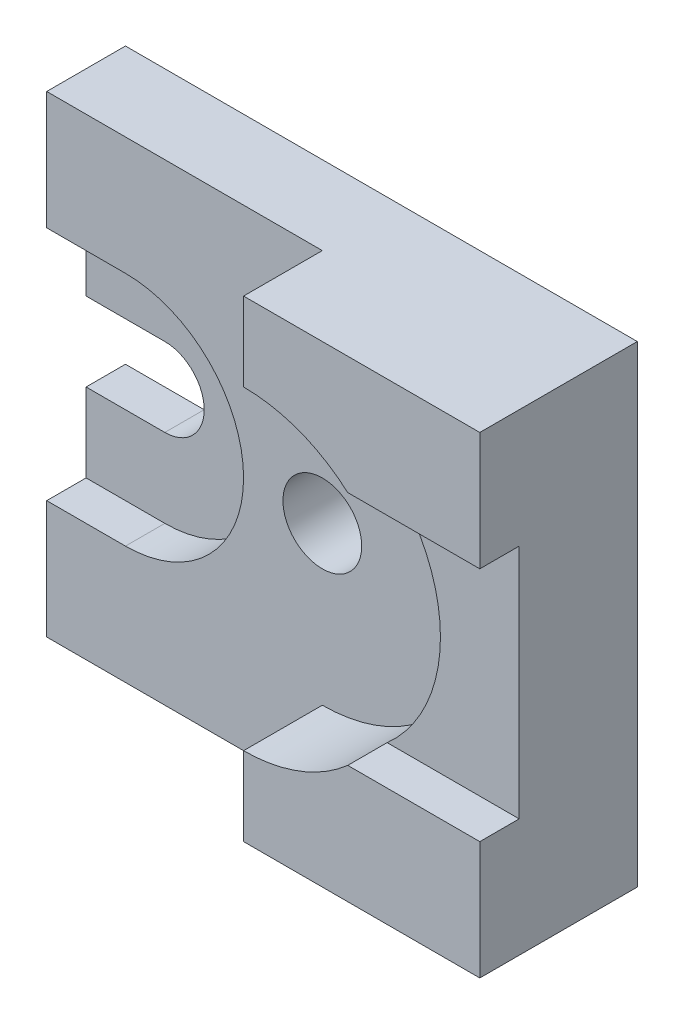
ISO-10303-21;
HEADER;
FILE_DESCRIPTION(('STEP AP214'),'2;1');
FILE_NAME('part.step','',(''),(''),'','','');
FILE_SCHEMA(('AUTOMOTIVE_DESIGN { 1 0 10303 214 1 1 1 1 }'));
ENDSEC;
DATA;
#1=APPLICATION_CONTEXT('core data for automotive mechanical design processes');
#2=APPLICATION_PROTOCOL_DEFINITION('international standard','automotive_design',2000,#1);
#3=PRODUCT_CONTEXT('',#1,'mechanical');
#4=PRODUCT('Part','Part','',(#3));
#5=PRODUCT_RELATED_PRODUCT_CATEGORY('part','',(#4));
#6=PRODUCT_DEFINITION_FORMATION('','',#4);
#7=PRODUCT_DEFINITION_CONTEXT('part definition',#1,'design');
#8=PRODUCT_DEFINITION('design','',#6,#7);
#9=PRODUCT_DEFINITION_SHAPE('','',#8);
#10=(LENGTH_UNIT() NAMED_UNIT(*) SI_UNIT(.MILLI.,.METRE.));
#11=(NAMED_UNIT(*) PLANE_ANGLE_UNIT() SI_UNIT($,.RADIAN.));
#12=(NAMED_UNIT(*) SI_UNIT($,.STERADIAN.) SOLID_ANGLE_UNIT());
#13=UNCERTAINTY_MEASURE_WITH_UNIT(LENGTH_MEASURE(1.E-05),#10,'distance_accuracy_value','');
#14=(GEOMETRIC_REPRESENTATION_CONTEXT(3) GLOBAL_UNCERTAINTY_ASSIGNED_CONTEXT((#13)) GLOBAL_UNIT_ASSIGNED_CONTEXT((#10,
#11,#12)) REPRESENTATION_CONTEXT('',''));
#15=CARTESIAN_POINT('',(0.,0.,0.));
#16=DIRECTION('',(0.,0.,1.));
#17=DIRECTION('',(1.,0.,0.));
#18=AXIS2_PLACEMENT_3D('',#15,#16,#17);
#19=CARTESIAN_POINT('',(0.,0.,40.));
#20=DIRECTION('',(0.,0.,-1.));
#21=DIRECTION('',(-1.,0.,0.));
#22=AXIS2_PLACEMENT_3D('',#19,#20,#21);
#23=PLANE('',#22);
#24=CARTESIAN_POINT('',(70.,60.,40.));
#25=DIRECTION('',(0.,0.,1.));
#26=DIRECTION('',(1.,0.,0.));
#27=AXIS2_PLACEMENT_3D('',#24,#25,#26);
#28=CIRCLE('',#27,40.);
#29=CARTESIAN_POINT('',(70.,100.,40.));
#30=VERTEX_POINT('',#29);
#31=CARTESIAN_POINT('',(96.4575131106459,90.,40.));
#32=VERTEX_POINT('',#31);
#33=EDGE_CURVE('E221',#30,#32,#28,.F.);
#34=ORIENTED_EDGE('',*,*,#33,.T.);
#35=DIRECTION('',(-1.,0.,0.));
#36=VECTOR('',#35,1.);
#37=CARTESIAN_POINT('',(96.4575131106459,90.,40.));
#38=LINE('',#37,#36);
#39=CARTESIAN_POINT('',(130.,90.,40.));
#40=VERTEX_POINT('',#39);
#41=EDGE_CURVE('E184',#40,#32,#38,.T.);
#42=ORIENTED_EDGE('',*,*,#41,.F.);
#43=DIRECTION('',(0.,1.,0.));
#44=VECTOR('',#43,1.);
#45=CARTESIAN_POINT('',(130.,0.,40.));
#46=LINE('',#45,#44);
#47=CARTESIAN_POINT('',(130.,120.,40.));
#48=VERTEX_POINT('',#47);
#49=EDGE_CURVE('E293',#40,#48,#46,.T.);
#50=ORIENTED_EDGE('',*,*,#49,.T.);
#51=DIRECTION('',(-1.,0.,0.));
#52=VECTOR('',#51,1.);
#53=CARTESIAN_POINT('',(0.,120.,40.));
#54=LINE('',#53,#52);
#55=CARTESIAN_POINT('',(70.,120.,40.));
#56=VERTEX_POINT('',#55);
#57=EDGE_CURVE('E298',#48,#56,#54,.T.);
#58=ORIENTED_EDGE('',*,*,#57,.T.);
#59=DIRECTION('',(0.,-1.,0.));
#60=VECTOR('',#59,1.);
#61=CARTESIAN_POINT('',(70.0000000000002,0.,40.));
#62=LINE('',#61,#60);
#63=EDGE_CURVE('E224',#56,#30,#62,.T.);
#64=ORIENTED_EDGE('',*,*,#63,.T.);
#65=EDGE_LOOP('',(#34,#42,#50,#58,#64));
#66=FACE_BOUND('',#65,.T.);
#67=ADVANCED_FACE('F32',(#66),#23,.F.);
#68=CARTESIAN_POINT('',(0.,0.,40.));
#69=DIRECTION('',(1.,0.,0.));
#70=DIRECTION('',(0.,0.,-1.));
#71=AXIS2_PLACEMENT_3D('',#68,#69,#70);
#72=PLANE('',#71);
#73=DIRECTION('',(0.,-1.,0.));
#74=VECTOR('',#73,1.);
#75=CARTESIAN_POINT('',(0.,0.,20.));
#76=LINE('',#75,#74);
#77=CARTESIAN_POINT('',(0.,120.,20.));
#78=VERTEX_POINT('',#77);
#79=CARTESIAN_POINT('',(0.,90.,20.));
#80=VERTEX_POINT('',#79);
#81=EDGE_CURVE('E56',#78,#80,#76,.T.);
#82=ORIENTED_EDGE('',*,*,#81,.F.);
#83=DIRECTION('',(0.,0.,-1.));
#84=VECTOR('',#83,1.);
#85=CARTESIAN_POINT('',(0.,120.,40.));
#86=LINE('',#85,#84);
#87=CARTESIAN_POINT('',(0.,120.,0.));
#88=VERTEX_POINT('',#87);
#89=EDGE_CURVE('E301',#78,#88,#86,.T.);
#90=ORIENTED_EDGE('',*,*,#89,.T.);
#91=DIRECTION('',(0.,-1.,0.));
#92=VECTOR('',#91,1.);
#93=CARTESIAN_POINT('',(0.,0.,0.));
#94=LINE('',#93,#92);
#95=CARTESIAN_POINT('',(0.,70.,0.));
#96=VERTEX_POINT('',#95);
#97=EDGE_CURVE('E302',#88,#96,#94,.T.);
#98=ORIENTED_EDGE('',*,*,#97,.T.);
#99=DIRECTION('',(0.,0.,1.));
#100=VECTOR('',#99,1.);
#101=CARTESIAN_POINT('',(0.,70.,0.));
#102=LINE('',#101,#100);
#103=CARTESIAN_POINT('',(0.,70.,10.));
#104=VERTEX_POINT('',#103);
#105=EDGE_CURVE('E279',#96,#104,#102,.T.);
#106=ORIENTED_EDGE('',*,*,#105,.T.);
#107=DIRECTION('',(0.,-1.,0.));
#108=VECTOR('',#107,1.);
#109=CARTESIAN_POINT('',(0.,70.,10.));
#110=LINE('',#109,#108);
#111=CARTESIAN_POINT('',(0.,90.,10.));
#112=VERTEX_POINT('',#111);
#113=EDGE_CURVE('E231',#112,#104,#110,.T.);
#114=ORIENTED_EDGE('',*,*,#113,.F.);
#115=DIRECTION('',(0.,0.,1.));
#116=VECTOR('',#115,1.);
#117=CARTESIAN_POINT('',(0.,90.,30.));
#118=LINE('',#117,#116);
#119=EDGE_CURVE('E264',#112,#80,#118,.T.);
#120=ORIENTED_EDGE('',*,*,#119,.T.);
#121=EDGE_LOOP('',(#82,#90,#98,#106,#114,#120));
#122=FACE_BOUND('',#121,.T.);
#123=ADVANCED_FACE('F34',(#122),#72,.F.);
#124=DIRECTION('',(0.,-1.,0.));
#125=VECTOR('',#124,1.);
#126=CARTESIAN_POINT('',(0.,0.,20.));
#127=LINE('',#126,#125);
#128=CARTESIAN_POINT('',(0.,30.,20.));
#129=VERTEX_POINT('',#128);
#130=CARTESIAN_POINT('',(0.,0.,20.));
#131=VERTEX_POINT('',#130);
#132=EDGE_CURVE('E210',#129,#131,#127,.T.);
#133=ORIENTED_EDGE('',*,*,#132,.F.);
#134=DIRECTION('',(0.,0.,1.));
#135=VECTOR('',#134,1.);
#136=CARTESIAN_POINT('',(0.,30.,30.));
#137=LINE('',#136,#135);
#138=CARTESIAN_POINT('',(0.,30.,10.));
#139=VERTEX_POINT('',#138);
#140=EDGE_CURVE('E261',#139,#129,#137,.T.);
#141=ORIENTED_EDGE('',*,*,#140,.F.);
#142=DIRECTION('',(0.,-1.,0.));
#143=VECTOR('',#142,1.);
#144=CARTESIAN_POINT('',(0.,30.,10.));
#145=LINE('',#144,#143);
#146=CARTESIAN_POINT('',(0.,50.,10.));
#147=VERTEX_POINT('',#146);
#148=EDGE_CURVE('E245',#147,#139,#145,.T.);
#149=ORIENTED_EDGE('',*,*,#148,.F.);
#150=DIRECTION('',(0.,0.,1.));
#151=VECTOR('',#150,1.);
#152=CARTESIAN_POINT('',(0.,50.,0.));
#153=LINE('',#152,#151);
#154=CARTESIAN_POINT('',(0.,50.,0.));
#155=VERTEX_POINT('',#154);
#156=EDGE_CURVE('E278',#155,#147,#153,.T.);
#157=ORIENTED_EDGE('',*,*,#156,.F.);
#158=CARTESIAN_POINT('',(0.,0.,0.));
#159=VERTEX_POINT('',#158);
#160=EDGE_CURVE('E282',#155,#159,#94,.T.);
#161=ORIENTED_EDGE('',*,*,#160,.T.);
#162=DIRECTION('',(0.,0.,-1.));
#163=VECTOR('',#162,1.);
#164=CARTESIAN_POINT('',(0.,0.,40.));
#165=LINE('',#164,#163);
#166=EDGE_CURVE('E11',#131,#159,#165,.T.);
#167=ORIENTED_EDGE('',*,*,#166,.F.);
#168=EDGE_LOOP('',(#133,#141,#149,#157,#161,#167));
#169=FACE_BOUND('',#168,.T.);
#170=ADVANCED_FACE('F373',(#169),#72,.F.);
#171=CARTESIAN_POINT('',(0.,120.,40.));
#172=DIRECTION('',(0.,-1.,0.));
#173=DIRECTION('',(0.,0.,-1.));
#174=AXIS2_PLACEMENT_3D('',#171,#172,#173);
#175=PLANE('',#174);
#176=DIRECTION('',(0.,0.,1.));
#177=VECTOR('',#176,1.);
#178=CARTESIAN_POINT('',(70.,120.,20.));
#179=LINE('',#178,#177);
#180=CARTESIAN_POINT('',(70.,120.,20.));
#181=VERTEX_POINT('',#180);
#182=EDGE_CURVE('E234',#181,#56,#179,.T.);
#183=ORIENTED_EDGE('',*,*,#182,.T.);
#184=ORIENTED_EDGE('',*,*,#57,.F.);
#185=DIRECTION('',(0.,0.,-1.));
#186=VECTOR('',#185,1.);
#187=CARTESIAN_POINT('',(130.,120.,40.));
#188=LINE('',#187,#186);
#189=CARTESIAN_POINT('',(130.,120.,0.));
#190=VERTEX_POINT('',#189);
#191=EDGE_CURVE('E312',#48,#190,#188,.T.);
#192=ORIENTED_EDGE('',*,*,#191,.T.);
#193=DIRECTION('',(-1.,0.,0.));
#194=VECTOR('',#193,1.);
#195=CARTESIAN_POINT('',(0.,120.,0.));
#196=LINE('',#195,#194);
#197=EDGE_CURVE('E294',#190,#88,#196,.T.);
#198=ORIENTED_EDGE('',*,*,#197,.T.);
#199=ORIENTED_EDGE('',*,*,#89,.F.);
#200=DIRECTION('',(-1.,0.,0.));
#201=VECTOR('',#200,1.);
#202=CARTESIAN_POINT('',(0.,120.,20.));
#203=LINE('',#202,#201);
#204=EDGE_CURVE('E201',#181,#78,#203,.T.);
#205=ORIENTED_EDGE('',*,*,#204,.F.);
#206=EDGE_LOOP('',(#183,#184,#192,#198,#199,#205));
#207=FACE_BOUND('',#206,.T.);
#208=ADVANCED_FACE('F333',(#207),#175,.F.);
#209=CARTESIAN_POINT('',(20.,60.,30.));
#210=DIRECTION('',(0.,0.,1.));
#211=DIRECTION('',(1.,0.,0.));
#212=AXIS2_PLACEMENT_3D('',#209,#210,#211);
#213=CYLINDRICAL_SURFACE('',#212,30.);
#214=DIRECTION('',(0.,0.,1.));
#215=VECTOR('',#214,1.);
#216=CARTESIAN_POINT('',(20.,30.,30.));
#217=LINE('',#216,#215);
#218=CARTESIAN_POINT('',(20.0000000000003,30.,10.));
#219=VERTEX_POINT('',#218);
#220=CARTESIAN_POINT('',(20.,30.,20.));
#221=VERTEX_POINT('',#220);
#222=EDGE_CURVE('E257',#219,#221,#217,.T.);
#223=ORIENTED_EDGE('',*,*,#222,.T.);
#224=CARTESIAN_POINT('',(20.,60.,20.));
#225=DIRECTION('',(0.,0.,1.));
#226=DIRECTION('',(1.,0.,0.));
#227=AXIS2_PLACEMENT_3D('',#224,#225,#226);
#228=CIRCLE('',#227,30.);
#229=CARTESIAN_POINT('',(20.,90.,20.));
#230=VERTEX_POINT('',#229);
#231=EDGE_CURVE('E206',#230,#221,#228,.F.);
#232=ORIENTED_EDGE('',*,*,#231,.F.);
#233=DIRECTION('',(0.,0.,1.));
#234=VECTOR('',#233,1.);
#235=CARTESIAN_POINT('',(20.,90.,30.));
#236=LINE('',#235,#234);
#237=CARTESIAN_POINT('',(20.,90.,10.));
#238=VERTEX_POINT('',#237);
#239=EDGE_CURVE('E267',#238,#230,#236,.T.);
#240=ORIENTED_EDGE('',*,*,#239,.F.);
#241=CARTESIAN_POINT('',(20.0000000000002,60.,10.));
#242=DIRECTION('',(0.,0.,1.));
#243=DIRECTION('',(-1.,0.,0.));
#244=AXIS2_PLACEMENT_3D('',#241,#242,#243);
#245=CIRCLE('',#244,30.);
#246=EDGE_CURVE('E251',#219,#238,#245,.T.);
#247=ORIENTED_EDGE('',*,*,#246,.F.);
#248=EDGE_LOOP('',(#223,#232,#240,#247));
#249=FACE_BOUND('',#248,.T.);
#250=ADVANCED_FACE('F365',(#249),#213,.F.);
#251=CARTESIAN_POINT('',(0.,30.,30.));
#252=DIRECTION('',(0.,-1.,0.));
#253=DIRECTION('',(0.,0.,-1.));
#254=AXIS2_PLACEMENT_3D('',#251,#252,#253);
#255=PLANE('',#254);
#256=DIRECTION('',(-1.,0.,0.));
#257=VECTOR('',#256,1.);
#258=CARTESIAN_POINT('',(0.,30.,20.));
#259=LINE('',#258,#257);
#260=EDGE_CURVE('E208',#221,#129,#259,.T.);
#261=ORIENTED_EDGE('',*,*,#260,.F.);
#262=ORIENTED_EDGE('',*,*,#222,.F.);
#263=DIRECTION('',(1.,0.,0.));
#264=VECTOR('',#263,1.);
#265=CARTESIAN_POINT('',(0.,30.,10.));
#266=LINE('',#265,#264);
#267=EDGE_CURVE('E248',#139,#219,#266,.T.);
#268=ORIENTED_EDGE('',*,*,#267,.F.);
#269=ORIENTED_EDGE('',*,*,#140,.T.);
#270=EDGE_LOOP('',(#261,#262,#268,#269));
#271=FACE_BOUND('',#270,.T.);
#272=ADVANCED_FACE('F370',(#271),#255,.F.);
#273=CARTESIAN_POINT('',(0.,90.,30.));
#274=DIRECTION('',(0.,-1.,0.));
#275=DIRECTION('',(0.,0.,-1.));
#276=AXIS2_PLACEMENT_3D('',#273,#274,#275);
#277=PLANE('',#276);
#278=ORIENTED_EDGE('',*,*,#239,.T.);
#279=DIRECTION('',(1.,0.,0.));
#280=VECTOR('',#279,1.);
#281=CARTESIAN_POINT('',(0.,90.,20.));
#282=LINE('',#281,#280);
#283=EDGE_CURVE('E204',#80,#230,#282,.T.);
#284=ORIENTED_EDGE('',*,*,#283,.F.);
#285=ORIENTED_EDGE('',*,*,#119,.F.);
#286=DIRECTION('',(-1.,0.,0.));
#287=VECTOR('',#286,1.);
#288=CARTESIAN_POINT('',(0.,90.,10.));
#289=LINE('',#288,#287);
#290=EDGE_CURVE('E254',#238,#112,#289,.T.);
#291=ORIENTED_EDGE('',*,*,#290,.F.);
#292=EDGE_LOOP('',(#278,#284,#285,#291));
#293=FACE_BOUND('',#292,.T.);
#294=ADVANCED_FACE('F358',(#293),#277,.T.);
#295=CARTESIAN_POINT('',(70.,60.,-119.));
#296=DIRECTION('',(0.,0.,1.));
#297=DIRECTION('',(1.,0.,0.));
#298=AXIS2_PLACEMENT_3D('',#295,#296,#297);
#299=CYLINDRICAL_SURFACE('',#298,9.99999999999999);
#300=CARTESIAN_POINT('',(70.,60.,0.));
#301=DIRECTION('',(0.,0.,-1.));
#302=DIRECTION('',(-1.,0.,0.));
#303=AXIS2_PLACEMENT_3D('',#300,#301,#302);
#304=CIRCLE('',#303,9.99999999999999);
#305=CARTESIAN_POINT('',(60.,60.,0.));
#306=VERTEX_POINT('',#305);
#307=EDGE_CURVE('E36',#306,#306,#304,.T.);
#308=ORIENTED_EDGE('',*,*,#307,.T.);
#309=EDGE_LOOP('',(#308));
#310=FACE_BOUND('',#309,.T.);
#311=CARTESIAN_POINT('',(70.,60.,20.));
#312=DIRECTION('',(0.,0.,1.));
#313=DIRECTION('',(1.,0.,0.));
#314=AXIS2_PLACEMENT_3D('',#311,#312,#313);
#315=CIRCLE('',#314,9.99999999999999);
#316=CARTESIAN_POINT('',(80.,60.,20.));
#317=VERTEX_POINT('',#316);
#318=EDGE_CURVE('E217',#317,#317,#315,.F.);
#319=ORIENTED_EDGE('',*,*,#318,.F.);
#320=EDGE_LOOP('',(#319));
#321=FACE_BOUND('',#320,.T.);
#322=ADVANCED_FACE('F428',(#310,#321),#299,.F.);
#323=CARTESIAN_POINT('',(0.,70.,0.));
#324=DIRECTION('',(0.,1.,0.));
#325=DIRECTION('',(0.,0.,1.));
#326=AXIS2_PLACEMENT_3D('',#323,#324,#325);
#327=PLANE('',#326);
#328=DIRECTION('',(0.,0.,1.));
#329=VECTOR('',#328,1.);
#330=CARTESIAN_POINT('',(20.,70.,0.));
#331=LINE('',#330,#329);
#332=CARTESIAN_POINT('',(20.,70.,0.));
#333=VERTEX_POINT('',#332);
#334=CARTESIAN_POINT('',(20.,70.,10.));
#335=VERTEX_POINT('',#334);
#336=EDGE_CURVE('E283',#333,#335,#331,.T.);
#337=ORIENTED_EDGE('',*,*,#336,.T.);
#338=DIRECTION('',(1.,0.,0.));
#339=VECTOR('',#338,1.);
#340=CARTESIAN_POINT('',(20.,70.,10.));
#341=LINE('',#340,#339);
#342=EDGE_CURVE('E239',#104,#335,#341,.T.);
#343=ORIENTED_EDGE('',*,*,#342,.F.);
#344=ORIENTED_EDGE('',*,*,#105,.F.);
#345=DIRECTION('',(-1.,0.,0.));
#346=VECTOR('',#345,1.);
#347=CARTESIAN_POINT('',(0.,70.,0.));
#348=LINE('',#347,#346);
#349=EDGE_CURVE('E275',#333,#96,#348,.T.);
#350=ORIENTED_EDGE('',*,*,#349,.F.);
#351=EDGE_LOOP('',(#337,#343,#344,#350));
#352=FACE_BOUND('',#351,.T.);
#353=ADVANCED_FACE('F423',(#352),#327,.F.);
#354=CARTESIAN_POINT('',(20.,60.,0.));
#355=DIRECTION('',(0.,0.,1.));
#356=DIRECTION('',(1.,0.,0.));
#357=AXIS2_PLACEMENT_3D('',#354,#355,#356);
#358=CYLINDRICAL_SURFACE('',#357,10.);
#359=DIRECTION('',(0.,0.,1.));
#360=VECTOR('',#359,1.);
#361=CARTESIAN_POINT('',(20.,50.,0.));
#362=LINE('',#361,#360);
#363=CARTESIAN_POINT('',(20.,50.,0.));
#364=VERTEX_POINT('',#363);
#365=CARTESIAN_POINT('',(20.0000000000001,50.,10.));
#366=VERTEX_POINT('',#365);
#367=EDGE_CURVE('E286',#364,#366,#362,.T.);
#368=ORIENTED_EDGE('',*,*,#367,.T.);
#369=CARTESIAN_POINT('',(20.,60.,10.));
#370=DIRECTION('',(0.,0.,-1.));
#371=DIRECTION('',(-1.,0.,0.));
#372=AXIS2_PLACEMENT_3D('',#369,#370,#371);
#373=CIRCLE('',#372,10.);
#374=EDGE_CURVE('E241',#335,#366,#373,.T.);
#375=ORIENTED_EDGE('',*,*,#374,.F.);
#376=ORIENTED_EDGE('',*,*,#336,.F.);
#377=CARTESIAN_POINT('',(20.,60.,0.));
#378=DIRECTION('',(0.,0.,1.));
#379=DIRECTION('',(-1.,0.,0.));
#380=AXIS2_PLACEMENT_3D('',#377,#378,#379);
#381=CIRCLE('',#380,10.);
#382=EDGE_CURVE('E272',#364,#333,#381,.T.);
#383=ORIENTED_EDGE('',*,*,#382,.F.);
#384=EDGE_LOOP('',(#368,#375,#376,#383));
#385=FACE_BOUND('',#384,.T.);
#386=ADVANCED_FACE('F418',(#385),#358,.F.);
#387=CARTESIAN_POINT('',(0.,50.,0.));
#388=DIRECTION('',(0.,-1.,0.));
#389=DIRECTION('',(0.,0.,-1.));
#390=AXIS2_PLACEMENT_3D('',#387,#388,#389);
#391=PLANE('',#390);
#392=ORIENTED_EDGE('',*,*,#156,.T.);
#393=DIRECTION('',(-1.,0.,0.));
#394=VECTOR('',#393,1.);
#395=CARTESIAN_POINT('',(0.,50.,10.));
#396=LINE('',#395,#394);
#397=EDGE_CURVE('E243',#366,#147,#396,.T.);
#398=ORIENTED_EDGE('',*,*,#397,.F.);
#399=ORIENTED_EDGE('',*,*,#367,.F.);
#400=DIRECTION('',(1.,0.,0.));
#401=VECTOR('',#400,1.);
#402=CARTESIAN_POINT('',(0.,50.,0.));
#403=LINE('',#402,#401);
#404=EDGE_CURVE('E260',#155,#364,#403,.T.);
#405=ORIENTED_EDGE('',*,*,#404,.F.);
#406=EDGE_LOOP('',(#392,#398,#399,#405));
#407=FACE_BOUND('',#406,.T.);
#408=ADVANCED_FACE('F414',(#407),#391,.F.);
#409=CARTESIAN_POINT('',(0.,0.,40.));
#410=DIRECTION('',(0.,1.,0.));
#411=DIRECTION('',(0.,0.,1.));
#412=AXIS2_PLACEMENT_3D('',#409,#410,#411);
#413=PLANE('',#412);
#414=DIRECTION('',(1.,0.,0.));
#415=VECTOR('',#414,1.);
#416=CARTESIAN_POINT('',(0.,0.,40.));
#417=LINE('',#416,#415);
#418=CARTESIAN_POINT('',(70.,0.,40.));
#419=VERTEX_POINT('',#418);
#420=CARTESIAN_POINT('',(130.,0.,40.));
#421=VERTEX_POINT('',#420);
#422=EDGE_CURVE('E291',#419,#421,#417,.T.);
#423=ORIENTED_EDGE('',*,*,#422,.F.);
#424=DIRECTION('',(0.,0.,1.));
#425=VECTOR('',#424,1.);
#426=CARTESIAN_POINT('',(70.,0.,20.));
#427=LINE('',#426,#425);
#428=CARTESIAN_POINT('',(70.,0.,20.));
#429=VERTEX_POINT('',#428);
#430=EDGE_CURVE('E232',#429,#419,#427,.T.);
#431=ORIENTED_EDGE('',*,*,#430,.F.);
#432=DIRECTION('',(1.,0.,0.));
#433=VECTOR('',#432,1.);
#434=CARTESIAN_POINT('',(0.,0.,20.));
#435=LINE('',#434,#433);
#436=EDGE_CURVE('E212',#131,#429,#435,.T.);
#437=ORIENTED_EDGE('',*,*,#436,.F.);
#438=ORIENTED_EDGE('',*,*,#166,.T.);
#439=DIRECTION('',(1.,0.,0.));
#440=VECTOR('',#439,1.);
#441=CARTESIAN_POINT('',(0.,0.,0.));
#442=LINE('',#441,#440);
#443=CARTESIAN_POINT('',(130.,0.,0.));
#444=VERTEX_POINT('',#443);
#445=EDGE_CURVE('E305',#159,#444,#442,.T.);
#446=ORIENTED_EDGE('',*,*,#445,.T.);
#447=DIRECTION('',(0.,0.,-1.));
#448=VECTOR('',#447,1.);
#449=CARTESIAN_POINT('',(130.,0.,40.));
#450=LINE('',#449,#448);
#451=EDGE_CURVE('E41',#421,#444,#450,.T.);
#452=ORIENTED_EDGE('',*,*,#451,.F.);
#453=EDGE_LOOP('',(#423,#431,#437,#438,#446,#452));
#454=FACE_BOUND('',#453,.T.);
#455=ADVANCED_FACE('F380',(#454),#413,.F.);
#456=CARTESIAN_POINT('',(130.,0.,40.));
#457=DIRECTION('',(-1.,0.,0.));
#458=DIRECTION('',(0.,0.,1.));
#459=AXIS2_PLACEMENT_3D('',#456,#457,#458);
#460=PLANE('',#459);
#461=ORIENTED_EDGE('',*,*,#49,.F.);
#462=DIRECTION('',(0.,0.,1.));
#463=VECTOR('',#462,1.);
#464=CARTESIAN_POINT('',(130.,90.,30.));
#465=LINE('',#464,#463);
#466=CARTESIAN_POINT('',(130.,90.,30.));
#467=VERTEX_POINT('',#466);
#468=EDGE_CURVE('E191',#467,#40,#465,.T.);
#469=ORIENTED_EDGE('',*,*,#468,.F.);
#470=DIRECTION('',(0.,1.,0.));
#471=VECTOR('',#470,1.);
#472=CARTESIAN_POINT('',(130.,90.,30.));
#473=LINE('',#472,#471);
#474=CARTESIAN_POINT('',(130.,30.,30.));
#475=VERTEX_POINT('',#474);
#476=EDGE_CURVE('E177',#475,#467,#473,.T.);
#477=ORIENTED_EDGE('',*,*,#476,.F.);
#478=DIRECTION('',(0.,0.,1.));
#479=VECTOR('',#478,1.);
#480=CARTESIAN_POINT('',(130.,30.,30.));
#481=LINE('',#480,#479);
#482=CARTESIAN_POINT('',(130.,30.,40.));
#483=VERTEX_POINT('',#482);
#484=EDGE_CURVE('E175',#475,#483,#481,.T.);
#485=ORIENTED_EDGE('',*,*,#484,.T.);
#486=EDGE_CURVE('E295',#421,#483,#46,.T.);
#487=ORIENTED_EDGE('',*,*,#486,.F.);
#488=ORIENTED_EDGE('',*,*,#451,.T.);
#489=DIRECTION('',(0.,1.,0.));
#490=VECTOR('',#489,1.);
#491=CARTESIAN_POINT('',(130.,0.,0.));
#492=LINE('',#491,#490);
#493=EDGE_CURVE('E307',#444,#190,#492,.T.);
#494=ORIENTED_EDGE('',*,*,#493,.T.);
#495=ORIENTED_EDGE('',*,*,#191,.F.);
#496=EDGE_LOOP('',(#461,#469,#477,#485,#487,#488,#494,#495));
#497=FACE_BOUND('',#496,.T.);
#498=ADVANCED_FACE('F321',(#497),#460,.F.);
#499=ORIENTED_EDGE('',*,*,#486,.T.);
#500=DIRECTION('',(1.,0.,0.));
#501=VECTOR('',#500,1.);
#502=CARTESIAN_POINT('',(130.,30.,40.));
#503=LINE('',#502,#501);
#504=CARTESIAN_POINT('',(96.4575131106459,30.,40.));
#505=VERTEX_POINT('',#504);
#506=EDGE_CURVE('E341',#505,#483,#503,.T.);
#507=ORIENTED_EDGE('',*,*,#506,.F.);
#508=CARTESIAN_POINT('',(70.,20.,40.));
#509=VERTEX_POINT('',#508);
#510=EDGE_CURVE('E189',#505,#509,#28,.F.);
#511=ORIENTED_EDGE('',*,*,#510,.T.);
#512=DIRECTION('',(0.,1.,0.));
#513=VECTOR('',#512,1.);
#514=CARTESIAN_POINT('',(70.,0.,40.));
#515=LINE('',#514,#513);
#516=EDGE_CURVE('E199',#419,#509,#515,.T.);
#517=ORIENTED_EDGE('',*,*,#516,.F.);
#518=ORIENTED_EDGE('',*,*,#422,.T.);
#519=EDGE_LOOP('',(#499,#507,#511,#517,#518));
#520=FACE_BOUND('',#519,.T.);
#521=ADVANCED_FACE('F386',(#520),#23,.F.);
#522=CARTESIAN_POINT('',(0.,0.,0.));
#523=DIRECTION('',(0.,0.,-1.));
#524=DIRECTION('',(-1.,0.,0.));
#525=AXIS2_PLACEMENT_3D('',#522,#523,#524);
#526=PLANE('',#525);
#527=ORIENTED_EDGE('',*,*,#307,.F.);
#528=EDGE_LOOP('',(#527));
#529=FACE_BOUND('',#528,.T.);
#530=ORIENTED_EDGE('',*,*,#349,.T.);
#531=ORIENTED_EDGE('',*,*,#97,.F.);
#532=ORIENTED_EDGE('',*,*,#197,.F.);
#533=ORIENTED_EDGE('',*,*,#493,.F.);
#534=ORIENTED_EDGE('',*,*,#445,.F.);
#535=ORIENTED_EDGE('',*,*,#160,.F.);
#536=ORIENTED_EDGE('',*,*,#404,.T.);
#537=ORIENTED_EDGE('',*,*,#382,.T.);
#538=EDGE_LOOP('',(#530,#531,#532,#533,#534,#535,#536,#537));
#539=FACE_BOUND('',#538,.T.);
#540=ADVANCED_FACE('F328',(#529,#539),#526,.T.);
#541=CARTESIAN_POINT('',(20.0000000000002,60.,10.));
#542=DIRECTION('',(0.,0.,-1.));
#543=DIRECTION('',(-1.,0.,0.));
#544=AXIS2_PLACEMENT_3D('',#541,#542,#543);
#545=PLANE('',#544);
#546=ORIENTED_EDGE('',*,*,#113,.T.);
#547=ORIENTED_EDGE('',*,*,#342,.T.);
#548=ORIENTED_EDGE('',*,*,#374,.T.);
#549=ORIENTED_EDGE('',*,*,#397,.T.);
#550=ORIENTED_EDGE('',*,*,#148,.T.);
#551=ORIENTED_EDGE('',*,*,#267,.T.);
#552=ORIENTED_EDGE('',*,*,#246,.T.);
#553=ORIENTED_EDGE('',*,*,#290,.T.);
#554=EDGE_LOOP('',(#546,#547,#548,#549,#550,#551,#552,#553));
#555=FACE_BOUND('',#554,.T.);
#556=ADVANCED_FACE('F360',(#555),#545,.F.);
#557=CARTESIAN_POINT('',(70.,60.,20.));
#558=DIRECTION('',(0.,0.,1.));
#559=DIRECTION('',(1.,0.,0.));
#560=AXIS2_PLACEMENT_3D('',#557,#558,#559);
#561=CYLINDRICAL_SURFACE('',#560,40.);
#562=DIRECTION('',(0.,0.,1.));
#563=VECTOR('',#562,1.);
#564=CARTESIAN_POINT('',(96.4575131106459,90.,30.));
#565=LINE('',#564,#563);
#566=CARTESIAN_POINT('',(96.4575131106459,90.,30.));
#567=VERTEX_POINT('',#566);
#568=EDGE_CURVE('E345',#567,#32,#565,.T.);
#569=ORIENTED_EDGE('',*,*,#568,.T.);
#570=ORIENTED_EDGE('',*,*,#33,.F.);
#571=DIRECTION('',(0.,0.,1.));
#572=VECTOR('',#571,1.);
#573=CARTESIAN_POINT('',(70.,100.,20.));
#574=LINE('',#573,#572);
#575=CARTESIAN_POINT('',(70.,100.,20.));
#576=VERTEX_POINT('',#575);
#577=EDGE_CURVE('E220',#576,#30,#574,.T.);
#578=ORIENTED_EDGE('',*,*,#577,.F.);
#579=CARTESIAN_POINT('',(70.,60.,20.));
#580=DIRECTION('',(0.,0.,1.));
#581=DIRECTION('',(1.,0.,0.));
#582=AXIS2_PLACEMENT_3D('',#579,#580,#581);
#583=CIRCLE('',#582,40.);
#584=CARTESIAN_POINT('',(70.,20.,20.));
#585=VERTEX_POINT('',#584);
#586=EDGE_CURVE('E196',#576,#585,#583,.F.);
#587=ORIENTED_EDGE('',*,*,#586,.T.);
#588=DIRECTION('',(0.,0.,1.));
#589=VECTOR('',#588,1.);
#590=CARTESIAN_POINT('',(70.,20.,20.));
#591=LINE('',#590,#589);
#592=EDGE_CURVE('E229',#585,#509,#591,.T.);
#593=ORIENTED_EDGE('',*,*,#592,.T.);
#594=ORIENTED_EDGE('',*,*,#510,.F.);
#595=DIRECTION('',(0.,0.,1.));
#596=VECTOR('',#595,1.);
#597=CARTESIAN_POINT('',(96.4575131106459,30.,30.));
#598=LINE('',#597,#596);
#599=CARTESIAN_POINT('',(96.4575131106459,30.,30.));
#600=VERTEX_POINT('',#599);
#601=EDGE_CURVE('E172',#600,#505,#598,.T.);
#602=ORIENTED_EDGE('',*,*,#601,.F.);
#603=CARTESIAN_POINT('',(70.,60.,30.));
#604=DIRECTION('',(0.,0.,-1.));
#605=DIRECTION('',(-1.,0.,0.));
#606=AXIS2_PLACEMENT_3D('',#603,#604,#605);
#607=CIRCLE('',#606,40.);
#608=EDGE_CURVE('E178',#567,#600,#607,.T.);
#609=ORIENTED_EDGE('',*,*,#608,.F.);
#610=EDGE_LOOP('',(#569,#570,#578,#587,#593,#594,#602,#609));
#611=FACE_BOUND('',#610,.T.);
#612=ADVANCED_FACE('F187',(#611),#561,.F.);
#613=CARTESIAN_POINT('',(70.,0.,20.));
#614=DIRECTION('',(1.,0.,0.));
#615=DIRECTION('',(0.,0.,-1.));
#616=AXIS2_PLACEMENT_3D('',#613,#614,#615);
#617=PLANE('',#616);
#618=ORIENTED_EDGE('',*,*,#516,.T.);
#619=ORIENTED_EDGE('',*,*,#592,.F.);
#620=DIRECTION('',(0.,1.,0.));
#621=VECTOR('',#620,1.);
#622=CARTESIAN_POINT('',(70.,0.,20.));
#623=LINE('',#622,#621);
#624=EDGE_CURVE('E214',#429,#585,#623,.T.);
#625=ORIENTED_EDGE('',*,*,#624,.F.);
#626=ORIENTED_EDGE('',*,*,#430,.T.);
#627=EDGE_LOOP('',(#618,#619,#625,#626));
#628=FACE_BOUND('',#627,.T.);
#629=ADVANCED_FACE('F383',(#628),#617,.F.);
#630=CARTESIAN_POINT('',(70.0000000000002,0.,20.));
#631=DIRECTION('',(-1.,0.,0.));
#632=DIRECTION('',(0.,-1.,0.));
#633=AXIS2_PLACEMENT_3D('',#630,#631,#632);
#634=PLANE('',#633);
#635=ORIENTED_EDGE('',*,*,#63,.F.);
#636=ORIENTED_EDGE('',*,*,#182,.F.);
#637=DIRECTION('',(0.,-1.,0.));
#638=VECTOR('',#637,1.);
#639=CARTESIAN_POINT('',(70.0000000000002,0.,20.));
#640=LINE('',#639,#638);
#641=EDGE_CURVE('E198',#181,#576,#640,.T.);
#642=ORIENTED_EDGE('',*,*,#641,.T.);
#643=ORIENTED_EDGE('',*,*,#577,.T.);
#644=EDGE_LOOP('',(#635,#636,#642,#643));
#645=FACE_BOUND('',#644,.T.);
#646=ADVANCED_FACE('F350',(#645),#634,.T.);
#647=CARTESIAN_POINT('',(0.,0.,20.));
#648=DIRECTION('',(0.,0.,1.));
#649=DIRECTION('',(1.,0.,0.));
#650=AXIS2_PLACEMENT_3D('',#647,#648,#649);
#651=PLANE('',#650);
#652=ORIENTED_EDGE('',*,*,#586,.F.);
#653=ORIENTED_EDGE('',*,*,#641,.F.);
#654=ORIENTED_EDGE('',*,*,#204,.T.);
#655=ORIENTED_EDGE('',*,*,#81,.T.);
#656=ORIENTED_EDGE('',*,*,#283,.T.);
#657=ORIENTED_EDGE('',*,*,#231,.T.);
#658=ORIENTED_EDGE('',*,*,#260,.T.);
#659=ORIENTED_EDGE('',*,*,#132,.T.);
#660=ORIENTED_EDGE('',*,*,#436,.T.);
#661=ORIENTED_EDGE('',*,*,#624,.T.);
#662=EDGE_LOOP('',(#652,#653,#654,#655,#656,#657,#658,#659,#660,#661));
#663=FACE_BOUND('',#662,.T.);
#664=ORIENTED_EDGE('',*,*,#318,.T.);
#665=EDGE_LOOP('',(#664));
#666=FACE_BOUND('',#665,.T.);
#667=ADVANCED_FACE('F352',(#663,#666),#651,.T.);
#668=CARTESIAN_POINT('',(96.4575131106459,90.,30.));
#669=DIRECTION('',(0.,1.,0.));
#670=DIRECTION('',(0.,0.,1.));
#671=AXIS2_PLACEMENT_3D('',#668,#669,#670);
#672=PLANE('',#671);
#673=ORIENTED_EDGE('',*,*,#41,.T.);
#674=ORIENTED_EDGE('',*,*,#568,.F.);
#675=DIRECTION('',(-1.,0.,0.));
#676=VECTOR('',#675,1.);
#677=CARTESIAN_POINT('',(96.4575131106459,90.,30.));
#678=LINE('',#677,#676);
#679=EDGE_CURVE('E48',#467,#567,#678,.T.);
#680=ORIENTED_EDGE('',*,*,#679,.F.);
#681=ORIENTED_EDGE('',*,*,#468,.T.);
#682=EDGE_LOOP('',(#673,#674,#680,#681));
#683=FACE_BOUND('',#682,.T.);
#684=ADVANCED_FACE('F346',(#683),#672,.F.);
#685=CARTESIAN_POINT('',(130.,30.,30.));
#686=DIRECTION('',(0.,-1.,0.));
#687=DIRECTION('',(1.,0.,0.));
#688=AXIS2_PLACEMENT_3D('',#685,#686,#687);
#689=PLANE('',#688);
#690=ORIENTED_EDGE('',*,*,#506,.T.);
#691=ORIENTED_EDGE('',*,*,#484,.F.);
#692=DIRECTION('',(1.,0.,0.));
#693=VECTOR('',#692,1.);
#694=CARTESIAN_POINT('',(130.,30.,30.));
#695=LINE('',#694,#693);
#696=EDGE_CURVE('E169',#600,#475,#695,.T.);
#697=ORIENTED_EDGE('',*,*,#696,.F.);
#698=ORIENTED_EDGE('',*,*,#601,.T.);
#699=EDGE_LOOP('',(#690,#691,#697,#698));
#700=FACE_BOUND('',#699,.T.);
#701=ADVANCED_FACE('F170',(#700),#689,.F.);
#702=CARTESIAN_POINT('',(70.,60.,30.));
#703=DIRECTION('',(0.,0.,-1.));
#704=DIRECTION('',(-1.,0.,0.));
#705=AXIS2_PLACEMENT_3D('',#702,#703,#704);
#706=PLANE('',#705);
#707=ORIENTED_EDGE('',*,*,#608,.T.);
#708=ORIENTED_EDGE('',*,*,#696,.T.);
#709=ORIENTED_EDGE('',*,*,#476,.T.);
#710=ORIENTED_EDGE('',*,*,#679,.T.);
#711=EDGE_LOOP('',(#707,#708,#709,#710));
#712=FACE_BOUND('',#711,.T.);
#713=ADVANCED_FACE('F181',(#712),#706,.F.);
#714=CLOSED_SHELL('',(#67,#123,#170,#208,#250,#272,#294,#322,#353,#386,#408,#455,#498,#521,#540,
#556,#612,#629,#646,#667,#684,#701,#713));
#715=MANIFOLD_SOLID_BREP('B2',#714);
#716=ADVANCED_BREP_SHAPE_REPRESENTATION('',(#18,#715),#14);
#717=SHAPE_DEFINITION_REPRESENTATION(#9,#716);
ENDSEC;
END-ISO-10303-21;
